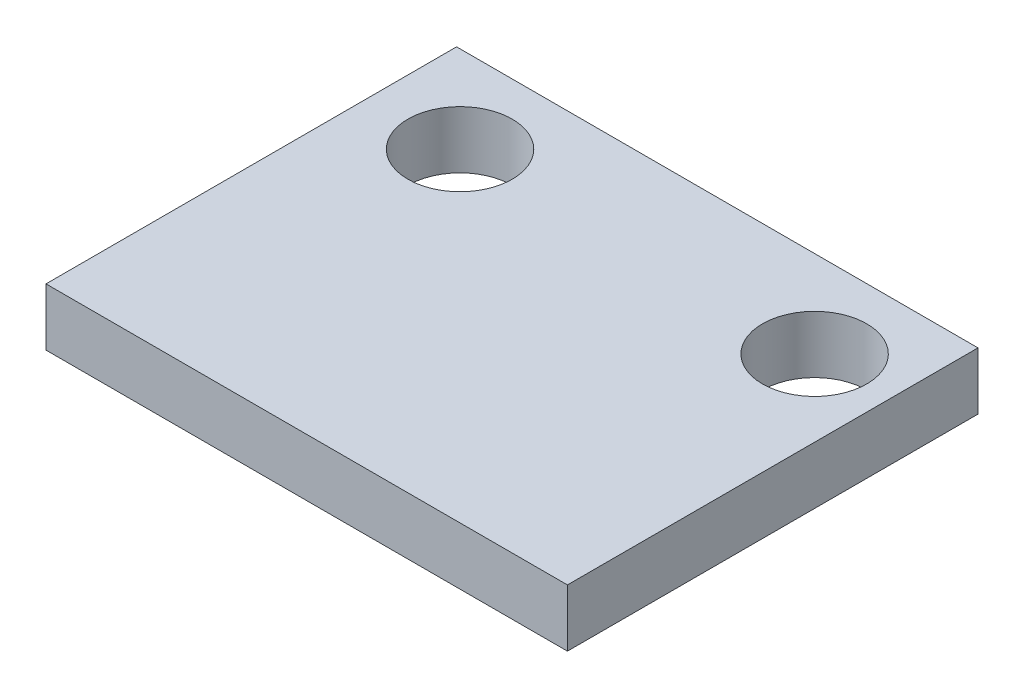
ISO-10303-21;
HEADER;
FILE_DESCRIPTION(('STEP AP214'),'2;1');
FILE_NAME('part.step','',(''),(''),'','','');
FILE_SCHEMA(('AUTOMOTIVE_DESIGN { 1 0 10303 214 1 1 1 1 }'));
ENDSEC;
DATA;
#1=APPLICATION_CONTEXT('core data for automotive mechanical design processes');
#2=APPLICATION_PROTOCOL_DEFINITION('international standard','automotive_design',2000,#1);
#3=PRODUCT_CONTEXT('',#1,'mechanical');
#4=PRODUCT('Part','Part','',(#3));
#5=PRODUCT_RELATED_PRODUCT_CATEGORY('part','',(#4));
#6=PRODUCT_DEFINITION_FORMATION('','',#4);
#7=PRODUCT_DEFINITION_CONTEXT('part definition',#1,'design');
#8=PRODUCT_DEFINITION('design','',#6,#7);
#9=PRODUCT_DEFINITION_SHAPE('','',#8);
#10=(LENGTH_UNIT() NAMED_UNIT(*) SI_UNIT(.MILLI.,.METRE.));
#11=(NAMED_UNIT(*) PLANE_ANGLE_UNIT() SI_UNIT($,.RADIAN.));
#12=(NAMED_UNIT(*) SI_UNIT($,.STERADIAN.) SOLID_ANGLE_UNIT());
#13=UNCERTAINTY_MEASURE_WITH_UNIT(LENGTH_MEASURE(1.E-05),#10,'distance_accuracy_value','');
#14=(GEOMETRIC_REPRESENTATION_CONTEXT(3) GLOBAL_UNCERTAINTY_ASSIGNED_CONTEXT((#13)) GLOBAL_UNIT_ASSIGNED_CONTEXT((#10,
#11,#12)) REPRESENTATION_CONTEXT('',''));
#15=CARTESIAN_POINT('',(0.,0.,0.));
#16=DIRECTION('',(0.,0.,1.));
#17=DIRECTION('',(1.,0.,0.));
#18=AXIS2_PLACEMENT_3D('',#15,#16,#17);
#19=CARTESIAN_POINT('',(0.,1.651,0.));
#20=DIRECTION('',(0.,-1.,0.));
#21=DIRECTION('',(0.,0.,-1.));
#22=AXIS2_PLACEMENT_3D('',#19,#20,#21);
#23=PLANE('',#22);
#24=DIRECTION('',(0.,0.,1.));
#25=VECTOR('',#24,1.);
#26=CARTESIAN_POINT('',(0.,1.651,0.));
#27=LINE('',#26,#25);
#28=CARTESIAN_POINT('',(0.,1.651,-11.811));
#29=VERTEX_POINT('',#28);
#30=CARTESIAN_POINT('',(0.,1.651,0.));
#31=VERTEX_POINT('',#30);
#32=EDGE_CURVE('E99',#29,#31,#27,.T.);
#33=ORIENTED_EDGE('',*,*,#32,.T.);
#34=DIRECTION('',(1.,0.,0.));
#35=VECTOR('',#34,1.);
#36=CARTESIAN_POINT('',(0.,1.651,0.));
#37=LINE('',#36,#35);
#38=CARTESIAN_POINT('',(15.,1.651,0.));
#39=VERTEX_POINT('',#38);
#40=EDGE_CURVE('E94',#31,#39,#37,.T.);
#41=ORIENTED_EDGE('',*,*,#40,.T.);
#42=DIRECTION('',(0.,0.,-1.));
#43=VECTOR('',#42,1.);
#44=CARTESIAN_POINT('',(15.,1.651,0.));
#45=LINE('',#44,#43);
#46=CARTESIAN_POINT('',(15.,1.651,-11.811));
#47=VERTEX_POINT('',#46);
#48=EDGE_CURVE('E97',#39,#47,#45,.T.);
#49=ORIENTED_EDGE('',*,*,#48,.T.);
#50=DIRECTION('',(-1.,0.,0.));
#51=VECTOR('',#50,1.);
#52=CARTESIAN_POINT('',(0.,1.651,-11.811));
#53=LINE('',#52,#51);
#54=EDGE_CURVE('E64',#47,#29,#53,.T.);
#55=ORIENTED_EDGE('',*,*,#54,.T.);
#56=EDGE_LOOP('',(#33,#41,#49,#55));
#57=FACE_BOUND('',#56,.T.);
#58=CARTESIAN_POINT('',(2.6,1.651,-9.311));
#59=DIRECTION('',(0.,1.,0.));
#60=DIRECTION('',(0.,0.,1.));
#61=AXIS2_PLACEMENT_3D('',#58,#59,#60);
#62=CIRCLE('',#61,1.5);
#63=CARTESIAN_POINT('',(2.6,1.651,-7.811));
#64=VERTEX_POINT('',#63);
#65=EDGE_CURVE('E114',#64,#64,#62,.T.);
#66=ORIENTED_EDGE('',*,*,#65,.F.);
#67=EDGE_LOOP('',(#66));
#68=FACE_BOUND('',#67,.T.);
#69=CARTESIAN_POINT('',(12.8,1.651,-9.311));
#70=DIRECTION('',(0.,1.,0.));
#71=DIRECTION('',(0.,0.,1.));
#72=AXIS2_PLACEMENT_3D('',#69,#70,#71);
#73=CIRCLE('',#72,1.5);
#74=CARTESIAN_POINT('',(12.8,1.651,-7.811));
#75=VERTEX_POINT('',#74);
#76=EDGE_CURVE('E129',#75,#75,#73,.T.);
#77=ORIENTED_EDGE('',*,*,#76,.F.);
#78=EDGE_LOOP('',(#77));
#79=FACE_BOUND('',#78,.T.);
#80=ADVANCED_FACE('F47',(#57,#68,#79),#23,.F.);
#81=CARTESIAN_POINT('',(0.,0.,0.));
#82=DIRECTION('',(0.,-1.,0.));
#83=DIRECTION('',(0.,0.,-1.));
#84=AXIS2_PLACEMENT_3D('',#81,#82,#83);
#85=PLANE('',#84);
#86=CARTESIAN_POINT('',(2.6,0.,-9.311));
#87=DIRECTION('',(0.,1.,0.));
#88=DIRECTION('',(0.,0.,1.));
#89=AXIS2_PLACEMENT_3D('',#86,#87,#88);
#90=CIRCLE('',#89,1.5);
#91=CARTESIAN_POINT('',(2.6,0.,-7.811));
#92=VERTEX_POINT('',#91);
#93=EDGE_CURVE('E126',#92,#92,#90,.T.);
#94=ORIENTED_EDGE('',*,*,#93,.T.);
#95=EDGE_LOOP('',(#94));
#96=FACE_BOUND('',#95,.T.);
#97=DIRECTION('',(0.,0.,1.));
#98=VECTOR('',#97,1.);
#99=CARTESIAN_POINT('',(0.,0.,0.));
#100=LINE('',#99,#98);
#101=CARTESIAN_POINT('',(0.,0.,-11.811));
#102=VERTEX_POINT('',#101);
#103=CARTESIAN_POINT('',(0.,0.,0.));
#104=VERTEX_POINT('',#103);
#105=EDGE_CURVE('E111',#102,#104,#100,.T.);
#106=ORIENTED_EDGE('',*,*,#105,.F.);
#107=DIRECTION('',(-1.,0.,0.));
#108=VECTOR('',#107,1.);
#109=CARTESIAN_POINT('',(0.,0.,-11.811));
#110=LINE('',#109,#108);
#111=CARTESIAN_POINT('',(15.,0.,-11.811));
#112=VERTEX_POINT('',#111);
#113=EDGE_CURVE('E87',#112,#102,#110,.T.);
#114=ORIENTED_EDGE('',*,*,#113,.F.);
#115=DIRECTION('',(0.,0.,-1.));
#116=VECTOR('',#115,1.);
#117=CARTESIAN_POINT('',(15.,0.,0.));
#118=LINE('',#117,#116);
#119=CARTESIAN_POINT('',(15.,0.,0.));
#120=VERTEX_POINT('',#119);
#121=EDGE_CURVE('E81',#120,#112,#118,.T.);
#122=ORIENTED_EDGE('',*,*,#121,.F.);
#123=DIRECTION('',(1.,0.,0.));
#124=VECTOR('',#123,1.);
#125=CARTESIAN_POINT('',(0.,0.,0.));
#126=LINE('',#125,#124);
#127=EDGE_CURVE('E103',#104,#120,#126,.T.);
#128=ORIENTED_EDGE('',*,*,#127,.F.);
#129=EDGE_LOOP('',(#106,#114,#122,#128));
#130=FACE_BOUND('',#129,.T.);
#131=CARTESIAN_POINT('',(12.8,0.,-9.311));
#132=DIRECTION('',(0.,1.,0.));
#133=DIRECTION('',(0.,0.,1.));
#134=AXIS2_PLACEMENT_3D('',#131,#132,#133);
#135=CIRCLE('',#134,1.5);
#136=CARTESIAN_POINT('',(12.8,0.,-7.811));
#137=VERTEX_POINT('',#136);
#138=EDGE_CURVE('E132',#137,#137,#135,.T.);
#139=ORIENTED_EDGE('',*,*,#138,.T.);
#140=EDGE_LOOP('',(#139));
#141=FACE_BOUND('',#140,.T.);
#142=ADVANCED_FACE('F122',(#96,#130,#141),#85,.T.);
#143=CARTESIAN_POINT('',(0.,1.651,0.));
#144=DIRECTION('',(1.,0.,0.));
#145=DIRECTION('',(0.,0.,-1.));
#146=AXIS2_PLACEMENT_3D('',#143,#144,#145);
#147=PLANE('',#146);
#148=ORIENTED_EDGE('',*,*,#105,.T.);
#149=DIRECTION('',(0.,-1.,0.));
#150=VECTOR('',#149,1.);
#151=CARTESIAN_POINT('',(0.,1.651,0.));
#152=LINE('',#151,#150);
#153=EDGE_CURVE('E11',#31,#104,#152,.T.);
#154=ORIENTED_EDGE('',*,*,#153,.F.);
#155=ORIENTED_EDGE('',*,*,#32,.F.);
#156=DIRECTION('',(0.,-1.,0.));
#157=VECTOR('',#156,1.);
#158=CARTESIAN_POINT('',(0.,1.651,-11.811));
#159=LINE('',#158,#157);
#160=EDGE_CURVE('E107',#29,#102,#159,.T.);
#161=ORIENTED_EDGE('',*,*,#160,.T.);
#162=EDGE_LOOP('',(#148,#154,#155,#161));
#163=FACE_BOUND('',#162,.T.);
#164=ADVANCED_FACE('F49',(#163),#147,.F.);
#165=CARTESIAN_POINT('',(0.,1.651,0.));
#166=DIRECTION('',(0.,0.,-1.));
#167=DIRECTION('',(-1.,0.,0.));
#168=AXIS2_PLACEMENT_3D('',#165,#166,#167);
#169=PLANE('',#168);
#170=ORIENTED_EDGE('',*,*,#127,.T.);
#171=DIRECTION('',(0.,-1.,0.));
#172=VECTOR('',#171,1.);
#173=CARTESIAN_POINT('',(15.,1.651,0.));
#174=LINE('',#173,#172);
#175=EDGE_CURVE('E56',#39,#120,#174,.T.);
#176=ORIENTED_EDGE('',*,*,#175,.F.);
#177=ORIENTED_EDGE('',*,*,#40,.F.);
#178=ORIENTED_EDGE('',*,*,#153,.T.);
#179=EDGE_LOOP('',(#170,#176,#177,#178));
#180=FACE_BOUND('',#179,.T.);
#181=ADVANCED_FACE('F102',(#180),#169,.F.);
#182=CARTESIAN_POINT('',(15.,1.651,0.));
#183=DIRECTION('',(-1.,0.,0.));
#184=DIRECTION('',(0.,0.,1.));
#185=AXIS2_PLACEMENT_3D('',#182,#183,#184);
#186=PLANE('',#185);
#187=ORIENTED_EDGE('',*,*,#121,.T.);
#188=DIRECTION('',(0.,-1.,0.));
#189=VECTOR('',#188,1.);
#190=CARTESIAN_POINT('',(15.,1.651,-11.811));
#191=LINE('',#190,#189);
#192=EDGE_CURVE('E104',#47,#112,#191,.T.);
#193=ORIENTED_EDGE('',*,*,#192,.F.);
#194=ORIENTED_EDGE('',*,*,#48,.F.);
#195=ORIENTED_EDGE('',*,*,#175,.T.);
#196=EDGE_LOOP('',(#187,#193,#194,#195));
#197=FACE_BOUND('',#196,.T.);
#198=ADVANCED_FACE('F105',(#197),#186,.F.);
#199=CARTESIAN_POINT('',(0.,1.651,-11.811));
#200=DIRECTION('',(0.,0.,1.));
#201=DIRECTION('',(1.,0.,0.));
#202=AXIS2_PLACEMENT_3D('',#199,#200,#201);
#203=PLANE('',#202);
#204=ORIENTED_EDGE('',*,*,#113,.T.);
#205=ORIENTED_EDGE('',*,*,#160,.F.);
#206=ORIENTED_EDGE('',*,*,#54,.F.);
#207=ORIENTED_EDGE('',*,*,#192,.T.);
#208=EDGE_LOOP('',(#204,#205,#206,#207));
#209=FACE_BOUND('',#208,.T.);
#210=ADVANCED_FACE('F119',(#209),#203,.F.);
#211=CARTESIAN_POINT('',(2.6,1.651,-9.311));
#212=DIRECTION('',(0.,-1.,0.));
#213=DIRECTION('',(0.,0.,-1.));
#214=AXIS2_PLACEMENT_3D('',#211,#212,#213);
#215=CYLINDRICAL_SURFACE('',#214,1.5);
#216=ORIENTED_EDGE('',*,*,#65,.T.);
#217=EDGE_LOOP('',(#216));
#218=FACE_BOUND('',#217,.T.);
#219=ORIENTED_EDGE('',*,*,#93,.F.);
#220=EDGE_LOOP('',(#219));
#221=FACE_BOUND('',#220,.T.);
#222=ADVANCED_FACE('F149',(#218,#221),#215,.F.);
#223=CARTESIAN_POINT('',(12.8,1.651,-9.311));
#224=DIRECTION('',(0.,-1.,0.));
#225=DIRECTION('',(0.,0.,-1.));
#226=AXIS2_PLACEMENT_3D('',#223,#224,#225);
#227=CYLINDRICAL_SURFACE('',#226,1.5);
#228=ORIENTED_EDGE('',*,*,#76,.T.);
#229=EDGE_LOOP('',(#228));
#230=FACE_BOUND('',#229,.T.);
#231=ORIENTED_EDGE('',*,*,#138,.F.);
#232=EDGE_LOOP('',(#231));
#233=FACE_BOUND('',#232,.T.);
#234=ADVANCED_FACE('F138',(#230,#233),#227,.F.);
#235=CLOSED_SHELL('',(#80,#142,#164,#181,#198,#210,#222,#234));
#236=MANIFOLD_SOLID_BREP('B2',#235);
#237=ADVANCED_BREP_SHAPE_REPRESENTATION('',(#18,#236),#14);
#238=SHAPE_DEFINITION_REPRESENTATION(#9,#237);
ENDSEC;
END-ISO-10303-21;
